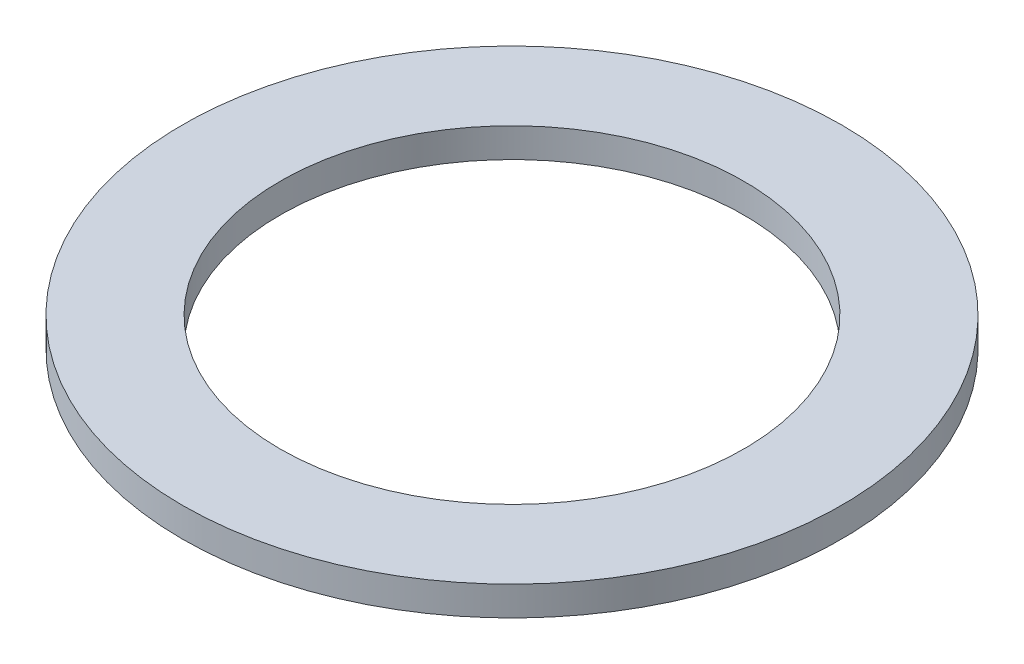
ISO-10303-21;
HEADER;
FILE_DESCRIPTION(('STEP AP214'),'2;1');
FILE_NAME('part.step','',(''),(''),'','','');
FILE_SCHEMA(('AUTOMOTIVE_DESIGN { 1 0 10303 214 1 1 1 1 }'));
ENDSEC;
DATA;
#1=APPLICATION_CONTEXT('core data for automotive mechanical design processes');
#2=APPLICATION_PROTOCOL_DEFINITION('international standard','automotive_design',2000,#1);
#3=PRODUCT_CONTEXT('',#1,'mechanical');
#4=PRODUCT('Part','Part','',(#3));
#5=PRODUCT_RELATED_PRODUCT_CATEGORY('part','',(#4));
#6=PRODUCT_DEFINITION_FORMATION('','',#4);
#7=PRODUCT_DEFINITION_CONTEXT('part definition',#1,'design');
#8=PRODUCT_DEFINITION('design','',#6,#7);
#9=PRODUCT_DEFINITION_SHAPE('','',#8);
#10=(LENGTH_UNIT() NAMED_UNIT(*) SI_UNIT(.MILLI.,.METRE.));
#11=(NAMED_UNIT(*) PLANE_ANGLE_UNIT() SI_UNIT($,.RADIAN.));
#12=(NAMED_UNIT(*) SI_UNIT($,.STERADIAN.) SOLID_ANGLE_UNIT());
#13=UNCERTAINTY_MEASURE_WITH_UNIT(LENGTH_MEASURE(1.E-05),#10,'distance_accuracy_value','');
#14=(GEOMETRIC_REPRESENTATION_CONTEXT(3) GLOBAL_UNCERTAINTY_ASSIGNED_CONTEXT((#13)) GLOBAL_UNIT_ASSIGNED_CONTEXT((#10,
#11,#12)) REPRESENTATION_CONTEXT('',''));
#15=CARTESIAN_POINT('',(0.,0.,0.));
#16=DIRECTION('',(0.,0.,1.));
#17=DIRECTION('',(1.,0.,0.));
#18=AXIS2_PLACEMENT_3D('',#15,#16,#17);
#19=CARTESIAN_POINT('',(0.,6.,0.));
#20=DIRECTION('',(0.,-1.,0.));
#21=DIRECTION('',(0.,0.,-1.));
#22=AXIS2_PLACEMENT_3D('',#19,#20,#21);
#23=CYLINDRICAL_SURFACE('',#22,67.5);
#24=CARTESIAN_POINT('',(0.,6.,0.));
#25=DIRECTION('',(0.,1.,0.));
#26=DIRECTION('',(0.,0.,1.));
#27=AXIS2_PLACEMENT_3D('',#24,#25,#26);
#28=CIRCLE('',#27,67.5);
#29=CARTESIAN_POINT('',(0.,6.,67.5));
#30=VERTEX_POINT('',#29);
#31=EDGE_CURVE('E10',#30,#30,#28,.T.);
#32=ORIENTED_EDGE('',*,*,#31,.F.);
#33=EDGE_LOOP('',(#32));
#34=FACE_BOUND('',#33,.T.);
#35=CARTESIAN_POINT('',(0.,0.,0.));
#36=DIRECTION('',(0.,1.,0.));
#37=DIRECTION('',(0.,0.,1.));
#38=AXIS2_PLACEMENT_3D('',#35,#36,#37);
#39=CIRCLE('',#38,67.5);
#40=CARTESIAN_POINT('',(0.,0.,67.5));
#41=VERTEX_POINT('',#40);
#42=EDGE_CURVE('E37',#41,#41,#39,.T.);
#43=ORIENTED_EDGE('',*,*,#42,.T.);
#44=EDGE_LOOP('',(#43));
#45=FACE_BOUND('',#44,.T.);
#46=ADVANCED_FACE('F40',(#34,#45),#23,.T.);
#47=CARTESIAN_POINT('',(0.,6.,0.));
#48=DIRECTION('',(0.,1.,0.));
#49=DIRECTION('',(0.,0.,1.));
#50=AXIS2_PLACEMENT_3D('',#47,#48,#49);
#51=PLANE('',#50);
#52=CARTESIAN_POINT('',(0.,6.,0.));
#53=DIRECTION('',(0.,1.,0.));
#54=DIRECTION('',(0.,0.,1.));
#55=AXIS2_PLACEMENT_3D('',#52,#53,#54);
#56=CIRCLE('',#55,47.5);
#57=CARTESIAN_POINT('',(0.,6.,47.5));
#58=VERTEX_POINT('',#57);
#59=EDGE_CURVE('E50',#58,#58,#56,.T.);
#60=ORIENTED_EDGE('',*,*,#59,.F.);
#61=EDGE_LOOP('',(#60));
#62=FACE_BOUND('',#61,.T.);
#63=ORIENTED_EDGE('',*,*,#31,.T.);
#64=EDGE_LOOP('',(#63));
#65=FACE_BOUND('',#64,.T.);
#66=ADVANCED_FACE('F59',(#62,#65),#51,.T.);
#67=CARTESIAN_POINT('',(0.,0.,0.));
#68=DIRECTION('',(0.,1.,0.));
#69=DIRECTION('',(0.,0.,1.));
#70=AXIS2_PLACEMENT_3D('',#67,#68,#69);
#71=PLANE('',#70);
#72=CARTESIAN_POINT('',(0.,0.,0.));
#73=DIRECTION('',(0.,1.,0.));
#74=DIRECTION('',(0.,0.,1.));
#75=AXIS2_PLACEMENT_3D('',#72,#73,#74);
#76=CIRCLE('',#75,47.5);
#77=CARTESIAN_POINT('',(0.,0.,47.5));
#78=VERTEX_POINT('',#77);
#79=EDGE_CURVE('E47',#78,#78,#76,.T.);
#80=ORIENTED_EDGE('',*,*,#79,.T.);
#81=EDGE_LOOP('',(#80));
#82=FACE_BOUND('',#81,.T.);
#83=ORIENTED_EDGE('',*,*,#42,.F.);
#84=EDGE_LOOP('',(#83));
#85=FACE_BOUND('',#84,.T.);
#86=ADVANCED_FACE('F58',(#82,#85),#71,.F.);
#87=CARTESIAN_POINT('',(0.,6.,0.));
#88=DIRECTION('',(0.,-1.,0.));
#89=DIRECTION('',(0.,0.,-1.));
#90=AXIS2_PLACEMENT_3D('',#87,#88,#89);
#91=CYLINDRICAL_SURFACE('',#90,47.5);
#92=ORIENTED_EDGE('',*,*,#59,.T.);
#93=EDGE_LOOP('',(#92));
#94=FACE_BOUND('',#93,.T.);
#95=ORIENTED_EDGE('',*,*,#79,.F.);
#96=EDGE_LOOP('',(#95));
#97=FACE_BOUND('',#96,.T.);
#98=ADVANCED_FACE('F54',(#94,#97),#91,.F.);
#99=CLOSED_SHELL('',(#46,#66,#86,#98));
#100=MANIFOLD_SOLID_BREP('B2',#99);
#101=ADVANCED_BREP_SHAPE_REPRESENTATION('',(#18,#100),#14);
#102=SHAPE_DEFINITION_REPRESENTATION(#9,#101);
ENDSEC;
END-ISO-10303-21;
